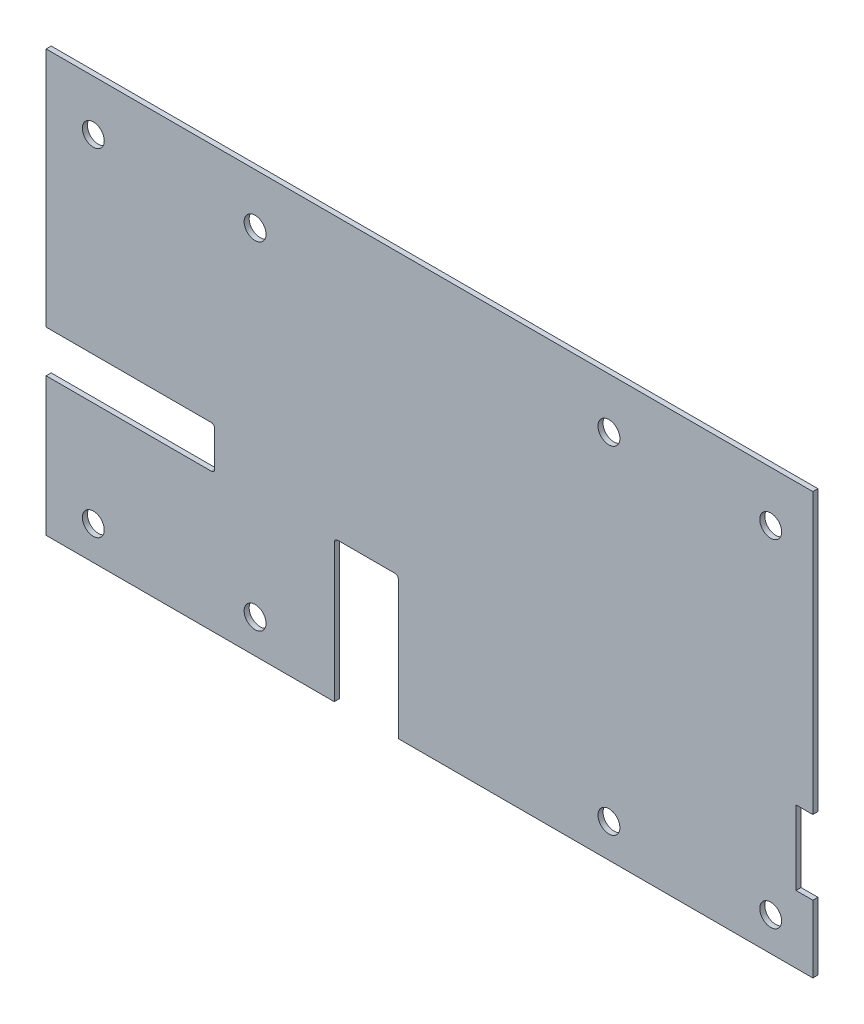
ISO-10303-21;
HEADER;
FILE_DESCRIPTION(('STEP AP214'),'2;1');
FILE_NAME('part.step','',(''),(''),'','','');
FILE_SCHEMA(('AUTOMOTIVE_DESIGN { 1 0 10303 214 1 1 1 1 }'));
ENDSEC;
DATA;
#1=APPLICATION_CONTEXT('core data for automotive mechanical design processes');
#2=APPLICATION_PROTOCOL_DEFINITION('international standard','automotive_design',2000,#1);
#3=PRODUCT_CONTEXT('',#1,'mechanical');
#4=PRODUCT('Part','Part','',(#3));
#5=PRODUCT_RELATED_PRODUCT_CATEGORY('part','',(#4));
#6=PRODUCT_DEFINITION_FORMATION('','',#4);
#7=PRODUCT_DEFINITION_CONTEXT('part definition',#1,'design');
#8=PRODUCT_DEFINITION('design','',#6,#7);
#9=PRODUCT_DEFINITION_SHAPE('','',#8);
#10=(LENGTH_UNIT() NAMED_UNIT(*) SI_UNIT(.MILLI.,.METRE.));
#11=(NAMED_UNIT(*) PLANE_ANGLE_UNIT() SI_UNIT($,.RADIAN.));
#12=(NAMED_UNIT(*) SI_UNIT($,.STERADIAN.) SOLID_ANGLE_UNIT());
#13=UNCERTAINTY_MEASURE_WITH_UNIT(LENGTH_MEASURE(1.E-05),#10,'distance_accuracy_value','');
#14=(GEOMETRIC_REPRESENTATION_CONTEXT(3) GLOBAL_UNCERTAINTY_ASSIGNED_CONTEXT((#13)) GLOBAL_UNIT_ASSIGNED_CONTEXT((#10,
#11,#12)) REPRESENTATION_CONTEXT('',''));
#15=CARTESIAN_POINT('',(0.,0.,0.));
#16=DIRECTION('',(0.,0.,1.));
#17=DIRECTION('',(1.,0.,0.));
#18=AXIS2_PLACEMENT_3D('',#15,#16,#17);
#19=CARTESIAN_POINT('',(-227.5,-125.,3.));
#20=DIRECTION('',(1.,0.,0.));
#21=DIRECTION('',(0.,0.,-1.));
#22=AXIS2_PLACEMENT_3D('',#19,#20,#21);
#23=PLANE('',#22);
#24=DIRECTION('',(0.,-1.,0.));
#25=VECTOR('',#24,1.);
#26=CARTESIAN_POINT('',(-227.5,-125.,0.));
#27=LINE('',#26,#25);
#28=CARTESIAN_POINT('',(-227.5,125.,0.));
#29=VERTEX_POINT('',#28);
#30=CARTESIAN_POINT('',(-227.5,-17.9999999999993,0.));
#31=VERTEX_POINT('',#30);
#32=EDGE_CURVE('E218',#29,#31,#27,.T.);
#33=ORIENTED_EDGE('',*,*,#32,.T.);
#34=DIRECTION('',(0.,0.,1.));
#35=VECTOR('',#34,1.);
#36=CARTESIAN_POINT('',(-227.5,-17.9999999999993,3.));
#37=LINE('',#36,#35);
#38=CARTESIAN_POINT('',(-227.5,-17.9999999999993,3.));
#39=VERTEX_POINT('',#38);
#40=EDGE_CURVE('E179',#31,#39,#37,.T.);
#41=ORIENTED_EDGE('',*,*,#40,.T.);
#42=DIRECTION('',(0.,-1.,0.));
#43=VECTOR('',#42,1.);
#44=CARTESIAN_POINT('',(-227.5,-125.,3.));
#45=LINE('',#44,#43);
#46=CARTESIAN_POINT('',(-227.5,125.,3.));
#47=VERTEX_POINT('',#46);
#48=EDGE_CURVE('E198',#47,#39,#45,.T.);
#49=ORIENTED_EDGE('',*,*,#48,.F.);
#50=DIRECTION('',(0.,0.,-1.));
#51=VECTOR('',#50,1.);
#52=CARTESIAN_POINT('',(-227.5,125.,3.));
#53=LINE('',#52,#51);
#54=EDGE_CURVE('E217',#47,#29,#53,.T.);
#55=ORIENTED_EDGE('',*,*,#54,.T.);
#56=EDGE_LOOP('',(#33,#41,#49,#55));
#57=FACE_BOUND('',#56,.T.);
#58=ADVANCED_FACE('F33',(#57),#23,.F.);
#59=CARTESIAN_POINT('',(227.5,-125.,3.));
#60=DIRECTION('',(0.,1.,0.));
#61=DIRECTION('',(-1.,0.,0.));
#62=AXIS2_PLACEMENT_3D('',#59,#60,#61);
#63=PLANE('',#62);
#64=DIRECTION('',(1.,0.,0.));
#65=VECTOR('',#64,1.);
#66=CARTESIAN_POINT('',(227.5,-125.,3.));
#67=LINE('',#66,#65);
#68=CARTESIAN_POINT('',(-18.5000000000001,-125.,3.));
#69=VERTEX_POINT('',#68);
#70=CARTESIAN_POINT('',(227.5,-125.,3.));
#71=VERTEX_POINT('',#70);
#72=EDGE_CURVE('E202',#69,#71,#67,.T.);
#73=ORIENTED_EDGE('',*,*,#72,.F.);
#74=DIRECTION('',(0.,0.,-1.));
#75=VECTOR('',#74,1.);
#76=CARTESIAN_POINT('',(-18.5000000000001,-125.,3.));
#77=LINE('',#76,#75);
#78=CARTESIAN_POINT('',(-18.5000000000001,-125.,0.));
#79=VERTEX_POINT('',#78);
#80=EDGE_CURVE('E180',#69,#79,#77,.T.);
#81=ORIENTED_EDGE('',*,*,#80,.T.);
#82=DIRECTION('',(1.,0.,0.));
#83=VECTOR('',#82,1.);
#84=CARTESIAN_POINT('',(227.5,-125.,0.));
#85=LINE('',#84,#83);
#86=CARTESIAN_POINT('',(227.5,-125.,0.));
#87=VERTEX_POINT('',#86);
#88=EDGE_CURVE('E221',#79,#87,#85,.T.);
#89=ORIENTED_EDGE('',*,*,#88,.T.);
#90=DIRECTION('',(0.,0.,-1.));
#91=VECTOR('',#90,1.);
#92=CARTESIAN_POINT('',(227.5,-125.,3.));
#93=LINE('',#92,#91);
#94=EDGE_CURVE('E234',#71,#87,#93,.T.);
#95=ORIENTED_EDGE('',*,*,#94,.F.);
#96=EDGE_LOOP('',(#73,#81,#89,#95));
#97=FACE_BOUND('',#96,.T.);
#98=ADVANCED_FACE('F373',(#97),#63,.F.);
#99=CARTESIAN_POINT('',(227.5,-125.,3.));
#100=DIRECTION('',(-1.,0.,0.));
#101=DIRECTION('',(0.,-1.,0.));
#102=AXIS2_PLACEMENT_3D('',#99,#100,#101);
#103=PLANE('',#102);
#104=DIRECTION('',(0.,1.,0.));
#105=VECTOR('',#104,1.);
#106=CARTESIAN_POINT('',(227.5,-125.,0.));
#107=LINE('',#106,#105);
#108=CARTESIAN_POINT('',(227.5,-85.,0.));
#109=VERTEX_POINT('',#108);
#110=EDGE_CURVE('E203',#87,#109,#107,.T.);
#111=ORIENTED_EDGE('',*,*,#110,.T.);
#112=DIRECTION('',(0.,0.,1.));
#113=VECTOR('',#112,1.);
#114=CARTESIAN_POINT('',(227.5,-85.,3.));
#115=LINE('',#114,#113);
#116=CARTESIAN_POINT('',(227.5,-85.,3.));
#117=VERTEX_POINT('',#116);
#118=EDGE_CURVE('E241',#109,#117,#115,.T.);
#119=ORIENTED_EDGE('',*,*,#118,.T.);
#120=DIRECTION('',(0.,1.,0.));
#121=VECTOR('',#120,1.);
#122=CARTESIAN_POINT('',(227.5,-125.,3.));
#123=LINE('',#122,#121);
#124=EDGE_CURVE('E212',#71,#117,#123,.T.);
#125=ORIENTED_EDGE('',*,*,#124,.F.);
#126=ORIENTED_EDGE('',*,*,#94,.T.);
#127=EDGE_LOOP('',(#111,#119,#125,#126));
#128=FACE_BOUND('',#127,.T.);
#129=ADVANCED_FACE('F379',(#128),#103,.F.);
#130=CARTESIAN_POINT('',(0.,0.,3.));
#131=DIRECTION('',(0.,0.,1.));
#132=DIRECTION('',(1.,0.,0.));
#133=AXIS2_PLACEMENT_3D('',#130,#131,#132);
#134=PLANE('',#133);
#135=DIRECTION('',(-1.,0.,0.));
#136=VECTOR('',#135,1.);
#137=CARTESIAN_POINT('',(-227.5,-17.9999999999993,3.));
#138=LINE('',#137,#136);
#139=CARTESIAN_POINT('',(-129.5,-17.9999999999993,3.));
#140=VERTEX_POINT('',#139);
#141=EDGE_CURVE('E289',#140,#39,#138,.T.);
#142=ORIENTED_EDGE('',*,*,#141,.F.);
#143=CARTESIAN_POINT('',(-129.5,-19.9999999999993,3.));
#144=DIRECTION('',(0.,0.,1.));
#145=DIRECTION('',(1.,0.,0.));
#146=AXIS2_PLACEMENT_3D('',#143,#144,#145);
#147=CIRCLE('',#146,2.);
#148=CARTESIAN_POINT('',(-127.5,-19.9999999999993,3.));
#149=VERTEX_POINT('',#148);
#150=EDGE_CURVE('E41',#140,#149,#147,.F.);
#151=ORIENTED_EDGE('',*,*,#150,.T.);
#152=DIRECTION('',(0.,1.,0.));
#153=VECTOR('',#152,1.);
#154=CARTESIAN_POINT('',(-127.5,-42.9999999999993,3.));
#155=LINE('',#154,#153);
#156=CARTESIAN_POINT('',(-127.5,-40.9999999999993,3.));
#157=VERTEX_POINT('',#156);
#158=EDGE_CURVE('E191',#157,#149,#155,.T.);
#159=ORIENTED_EDGE('',*,*,#158,.F.);
#160=CARTESIAN_POINT('',(-129.5,-40.9999999999993,3.));
#161=DIRECTION('',(0.,0.,1.));
#162=DIRECTION('',(1.,0.,0.));
#163=AXIS2_PLACEMENT_3D('',#160,#161,#162);
#164=CIRCLE('',#163,2.);
#165=CARTESIAN_POINT('',(-129.5,-42.9999999999993,3.));
#166=VERTEX_POINT('',#165);
#167=EDGE_CURVE('E190',#157,#166,#164,.F.);
#168=ORIENTED_EDGE('',*,*,#167,.T.);
#169=DIRECTION('',(1.,0.,0.));
#170=VECTOR('',#169,1.);
#171=CARTESIAN_POINT('',(-227.5,-42.9999999999993,3.));
#172=LINE('',#171,#170);
#173=CARTESIAN_POINT('',(-227.5,-42.9999999999993,3.));
#174=VERTEX_POINT('',#173);
#175=EDGE_CURVE('E172',#174,#166,#172,.T.);
#176=ORIENTED_EDGE('',*,*,#175,.F.);
#177=CARTESIAN_POINT('',(-227.5,-125.,3.));
#178=VERTEX_POINT('',#177);
#179=EDGE_CURVE('E187',#174,#178,#45,.T.);
#180=ORIENTED_EDGE('',*,*,#179,.T.);
#181=CARTESIAN_POINT('',(-56.5000000000001,-125.,3.));
#182=VERTEX_POINT('',#181);
#183=EDGE_CURVE('E209',#178,#182,#67,.T.);
#184=ORIENTED_EDGE('',*,*,#183,.T.);
#185=DIRECTION('',(0.,-1.,0.));
#186=VECTOR('',#185,1.);
#187=CARTESIAN_POINT('',(-56.5000000000001,-41.0000000000001,3.));
#188=LINE('',#187,#186);
#189=CARTESIAN_POINT('',(-56.5000000000001,-43.0000000000001,3.));
#190=VERTEX_POINT('',#189);
#191=EDGE_CURVE('E192',#190,#182,#188,.T.);
#192=ORIENTED_EDGE('',*,*,#191,.F.);
#193=CARTESIAN_POINT('',(-54.5000000000001,-43.0000000000001,3.));
#194=DIRECTION('',(0.,0.,1.));
#195=DIRECTION('',(1.,0.,0.));
#196=AXIS2_PLACEMENT_3D('',#193,#194,#195);
#197=CIRCLE('',#196,2.);
#198=CARTESIAN_POINT('',(-54.5000000000001,-41.0000000000001,3.));
#199=VERTEX_POINT('',#198);
#200=EDGE_CURVE('E282',#190,#199,#197,.F.);
#201=ORIENTED_EDGE('',*,*,#200,.T.);
#202=DIRECTION('',(-1.,0.,0.));
#203=VECTOR('',#202,1.);
#204=CARTESIAN_POINT('',(-18.5000000000001,-41.,3.));
#205=LINE('',#204,#203);
#206=CARTESIAN_POINT('',(-20.5000000000001,-41.,3.));
#207=VERTEX_POINT('',#206);
#208=EDGE_CURVE('E431',#207,#199,#205,.T.);
#209=ORIENTED_EDGE('',*,*,#208,.F.);
#210=CARTESIAN_POINT('',(-20.5000000000001,-43.,3.));
#211=DIRECTION('',(0.,0.,1.));
#212=DIRECTION('',(1.,0.,0.));
#213=AXIS2_PLACEMENT_3D('',#210,#211,#212);
#214=CIRCLE('',#213,2.);
#215=CARTESIAN_POINT('',(-18.5000000000001,-43.,3.));
#216=VERTEX_POINT('',#215);
#217=EDGE_CURVE('E278',#207,#216,#214,.F.);
#218=ORIENTED_EDGE('',*,*,#217,.T.);
#219=DIRECTION('',(0.,1.,0.));
#220=VECTOR('',#219,1.);
#221=CARTESIAN_POINT('',(-18.5000000000001,-41.,3.));
#222=LINE('',#221,#220);
#223=EDGE_CURVE('E436',#69,#216,#222,.T.);
#224=ORIENTED_EDGE('',*,*,#223,.F.);
#225=ORIENTED_EDGE('',*,*,#72,.T.);
#226=ORIENTED_EDGE('',*,*,#124,.T.);
#227=DIRECTION('',(1.,0.,0.));
#228=VECTOR('',#227,1.);
#229=CARTESIAN_POINT('',(227.5,-85.,3.));
#230=LINE('',#229,#228);
#231=CARTESIAN_POINT('',(217.5,-85.,3.));
#232=VERTEX_POINT('',#231);
#233=EDGE_CURVE('E449',#232,#117,#230,.T.);
#234=ORIENTED_EDGE('',*,*,#233,.F.);
#235=DIRECTION('',(0.,-1.,0.));
#236=VECTOR('',#235,1.);
#237=CARTESIAN_POINT('',(217.5,-41.,3.));
#238=LINE('',#237,#236);
#239=CARTESIAN_POINT('',(217.5,-41.,3.));
#240=VERTEX_POINT('',#239);
#241=EDGE_CURVE('E446',#240,#232,#238,.T.);
#242=ORIENTED_EDGE('',*,*,#241,.F.);
#243=DIRECTION('',(-1.,0.,0.));
#244=VECTOR('',#243,1.);
#245=CARTESIAN_POINT('',(227.5,-41.,3.));
#246=LINE('',#245,#244);
#247=CARTESIAN_POINT('',(227.5,-41.,3.));
#248=VERTEX_POINT('',#247);
#249=EDGE_CURVE('E443',#248,#240,#246,.T.);
#250=ORIENTED_EDGE('',*,*,#249,.F.);
#251=CARTESIAN_POINT('',(227.5,125.,3.));
#252=VERTEX_POINT('',#251);
#253=EDGE_CURVE('E211',#248,#252,#123,.T.);
#254=ORIENTED_EDGE('',*,*,#253,.T.);
#255=DIRECTION('',(-1.,0.,0.));
#256=VECTOR('',#255,1.);
#257=CARTESIAN_POINT('',(227.5,125.,3.));
#258=LINE('',#257,#256);
#259=EDGE_CURVE('E215',#252,#47,#258,.T.);
#260=ORIENTED_EDGE('',*,*,#259,.T.);
#261=ORIENTED_EDGE('',*,*,#48,.T.);
#262=EDGE_LOOP('',(#142,#151,#159,#168,#176,#180,#184,#192,#201,#209,#218,#224,#225,#226,#234,
#242,#250,#254,#260,#261));
#263=FACE_BOUND('',#262,.T.);
#264=CARTESIAN_POINT('',(-199.5,95.0000000000001,3.));
#265=DIRECTION('',(0.,0.,1.));
#266=DIRECTION('',(1.,0.,0.));
#267=AXIS2_PLACEMENT_3D('',#264,#265,#266);
#268=CIRCLE('',#267,6.50000000000002);
#269=CARTESIAN_POINT('',(-193.,95.0000000000001,3.));
#270=VERTEX_POINT('',#269);
#271=EDGE_CURVE('E312',#270,#270,#268,.T.);
#272=ORIENTED_EDGE('',*,*,#271,.F.);
#273=EDGE_LOOP('',(#272));
#274=FACE_BOUND('',#273,.T.);
#275=CARTESIAN_POINT('',(-103.5,-105.,3.));
#276=DIRECTION('',(0.,0.,1.));
#277=DIRECTION('',(1.,0.,0.));
#278=AXIS2_PLACEMENT_3D('',#275,#276,#277);
#279=CIRCLE('',#278,6.50000000000002);
#280=CARTESIAN_POINT('',(-96.9999999999999,-105.,3.));
#281=VERTEX_POINT('',#280);
#282=EDGE_CURVE('E324',#281,#281,#279,.T.);
#283=ORIENTED_EDGE('',*,*,#282,.F.);
#284=EDGE_LOOP('',(#283));
#285=FACE_BOUND('',#284,.T.);
#286=CARTESIAN_POINT('',(106.5,-105.,3.));
#287=DIRECTION('',(0.,0.,1.));
#288=DIRECTION('',(1.,0.,0.));
#289=AXIS2_PLACEMENT_3D('',#286,#287,#288);
#290=CIRCLE('',#289,6.50000000000002);
#291=CARTESIAN_POINT('',(113.,-105.,3.));
#292=VERTEX_POINT('',#291);
#293=EDGE_CURVE('E336',#292,#292,#290,.T.);
#294=ORIENTED_EDGE('',*,*,#293,.F.);
#295=EDGE_LOOP('',(#294));
#296=FACE_BOUND('',#295,.T.);
#297=CARTESIAN_POINT('',(106.5,95.0000000000001,3.));
#298=DIRECTION('',(0.,0.,1.));
#299=DIRECTION('',(1.,0.,0.));
#300=AXIS2_PLACEMENT_3D('',#297,#298,#299);
#301=CIRCLE('',#300,6.50000000000002);
#302=CARTESIAN_POINT('',(113.,95.0000000000001,3.));
#303=VERTEX_POINT('',#302);
#304=EDGE_CURVE('E346',#303,#303,#301,.T.);
#305=ORIENTED_EDGE('',*,*,#304,.F.);
#306=EDGE_LOOP('',(#305));
#307=FACE_BOUND('',#306,.T.);
#308=CARTESIAN_POINT('',(202.5,95.0000000000001,3.));
#309=DIRECTION('',(0.,0.,1.));
#310=DIRECTION('',(1.,0.,0.));
#311=AXIS2_PLACEMENT_3D('',#308,#309,#310);
#312=CIRCLE('',#311,6.50000000000002);
#313=CARTESIAN_POINT('',(209.,95.0000000000001,3.));
#314=VERTEX_POINT('',#313);
#315=EDGE_CURVE('E342',#314,#314,#312,.T.);
#316=ORIENTED_EDGE('',*,*,#315,.F.);
#317=EDGE_LOOP('',(#316));
#318=FACE_BOUND('',#317,.T.);
#319=CARTESIAN_POINT('',(202.5,-105.,3.));
#320=DIRECTION('',(0.,0.,1.));
#321=DIRECTION('',(1.,0.,0.));
#322=AXIS2_PLACEMENT_3D('',#319,#320,#321);
#323=CIRCLE('',#322,6.50000000000007);
#324=CARTESIAN_POINT('',(209.,-105.,3.));
#325=VERTEX_POINT('',#324);
#326=EDGE_CURVE('E330',#325,#325,#323,.T.);
#327=ORIENTED_EDGE('',*,*,#326,.F.);
#328=EDGE_LOOP('',(#327));
#329=FACE_BOUND('',#328,.T.);
#330=CARTESIAN_POINT('',(-103.5,95.0000000000001,3.));
#331=DIRECTION('',(0.,0.,1.));
#332=DIRECTION('',(1.,0.,0.));
#333=AXIS2_PLACEMENT_3D('',#330,#331,#332);
#334=CIRCLE('',#333,6.50000000000002);
#335=CARTESIAN_POINT('',(-97.,95.0000000000001,3.));
#336=VERTEX_POINT('',#335);
#337=EDGE_CURVE('E318',#336,#336,#334,.T.);
#338=ORIENTED_EDGE('',*,*,#337,.F.);
#339=EDGE_LOOP('',(#338));
#340=FACE_BOUND('',#339,.T.);
#341=CARTESIAN_POINT('',(-199.5,-105.,3.));
#342=DIRECTION('',(0.,0.,1.));
#343=DIRECTION('',(1.,0.,0.));
#344=AXIS2_PLACEMENT_3D('',#341,#342,#343);
#345=CIRCLE('',#344,6.50000000000002);
#346=CARTESIAN_POINT('',(-193.,-105.,3.));
#347=VERTEX_POINT('',#346);
#348=EDGE_CURVE('E303',#347,#347,#345,.T.);
#349=ORIENTED_EDGE('',*,*,#348,.F.);
#350=EDGE_LOOP('',(#349));
#351=FACE_BOUND('',#350,.T.);
#352=ADVANCED_FACE('F184',(#263,#274,#285,#296,#307,#318,#329,#340,#351),#134,.T.);
#353=CARTESIAN_POINT('',(0.,0.,0.));
#354=DIRECTION('',(0.,0.,1.));
#355=DIRECTION('',(1.,0.,0.));
#356=AXIS2_PLACEMENT_3D('',#353,#354,#355);
#357=PLANE('',#356);
#358=DIRECTION('',(1.,0.,0.));
#359=VECTOR('',#358,1.);
#360=CARTESIAN_POINT('',(0.,-42.9999999999993,0.));
#361=LINE('',#360,#359);
#362=CARTESIAN_POINT('',(-227.5,-42.9999999999993,0.));
#363=VERTEX_POINT('',#362);
#364=CARTESIAN_POINT('',(-129.5,-42.9999999999993,0.));
#365=VERTEX_POINT('',#364);
#366=EDGE_CURVE('E175',#363,#365,#361,.T.);
#367=ORIENTED_EDGE('',*,*,#366,.T.);
#368=CARTESIAN_POINT('',(-129.5,-40.9999999999993,0.));
#369=DIRECTION('',(0.,0.,1.));
#370=DIRECTION('',(1.,0.,0.));
#371=AXIS2_PLACEMENT_3D('',#368,#369,#370);
#372=CIRCLE('',#371,2.);
#373=CARTESIAN_POINT('',(-127.5,-40.9999999999993,0.));
#374=VERTEX_POINT('',#373);
#375=EDGE_CURVE('E287',#365,#374,#372,.T.);
#376=ORIENTED_EDGE('',*,*,#375,.T.);
#377=DIRECTION('',(0.,1.,0.));
#378=VECTOR('',#377,1.);
#379=CARTESIAN_POINT('',(-127.5,0.,0.));
#380=LINE('',#379,#378);
#381=CARTESIAN_POINT('',(-127.5,-19.9999999999993,0.));
#382=VERTEX_POINT('',#381);
#383=EDGE_CURVE('E257',#374,#382,#380,.T.);
#384=ORIENTED_EDGE('',*,*,#383,.T.);
#385=CARTESIAN_POINT('',(-129.5,-19.9999999999993,0.));
#386=DIRECTION('',(0.,0.,1.));
#387=DIRECTION('',(1.,0.,0.));
#388=AXIS2_PLACEMENT_3D('',#385,#386,#387);
#389=CIRCLE('',#388,2.);
#390=CARTESIAN_POINT('',(-129.5,-17.9999999999993,0.));
#391=VERTEX_POINT('',#390);
#392=EDGE_CURVE('E11',#382,#391,#389,.T.);
#393=ORIENTED_EDGE('',*,*,#392,.T.);
#394=DIRECTION('',(-1.,0.,0.));
#395=VECTOR('',#394,1.);
#396=CARTESIAN_POINT('',(0.,-17.9999999999993,0.));
#397=LINE('',#396,#395);
#398=EDGE_CURVE('E298',#391,#31,#397,.T.);
#399=ORIENTED_EDGE('',*,*,#398,.T.);
#400=ORIENTED_EDGE('',*,*,#32,.F.);
#401=DIRECTION('',(-1.,0.,0.));
#402=VECTOR('',#401,1.);
#403=CARTESIAN_POINT('',(227.5,125.,0.));
#404=LINE('',#403,#402);
#405=CARTESIAN_POINT('',(227.5,125.,0.));
#406=VERTEX_POINT('',#405);
#407=EDGE_CURVE('E199',#406,#29,#404,.T.);
#408=ORIENTED_EDGE('',*,*,#407,.F.);
#409=CARTESIAN_POINT('',(227.5,-41.,0.));
#410=VERTEX_POINT('',#409);
#411=EDGE_CURVE('E226',#410,#406,#107,.T.);
#412=ORIENTED_EDGE('',*,*,#411,.F.);
#413=DIRECTION('',(-1.,0.,0.));
#414=VECTOR('',#413,1.);
#415=CARTESIAN_POINT('',(0.,-40.9999999999998,0.));
#416=LINE('',#415,#414);
#417=CARTESIAN_POINT('',(217.5,-41.,0.));
#418=VERTEX_POINT('',#417);
#419=EDGE_CURVE('E415',#410,#418,#416,.T.);
#420=ORIENTED_EDGE('',*,*,#419,.T.);
#421=DIRECTION('',(0.,-1.,0.));
#422=VECTOR('',#421,1.);
#423=CARTESIAN_POINT('',(217.5,0.,0.));
#424=LINE('',#423,#422);
#425=CARTESIAN_POINT('',(217.5,-85.,0.));
#426=VERTEX_POINT('',#425);
#427=EDGE_CURVE('E251',#418,#426,#424,.T.);
#428=ORIENTED_EDGE('',*,*,#427,.T.);
#429=DIRECTION('',(1.,0.,0.));
#430=VECTOR('',#429,1.);
#431=CARTESIAN_POINT('',(-1.17961196366422E-13,-84.9999999999997,0.));
#432=LINE('',#431,#430);
#433=EDGE_CURVE('E410',#426,#109,#432,.T.);
#434=ORIENTED_EDGE('',*,*,#433,.T.);
#435=ORIENTED_EDGE('',*,*,#110,.F.);
#436=ORIENTED_EDGE('',*,*,#88,.F.);
#437=DIRECTION('',(0.,1.,0.));
#438=VECTOR('',#437,1.);
#439=CARTESIAN_POINT('',(-18.5000000000001,0.,0.));
#440=LINE('',#439,#438);
#441=CARTESIAN_POINT('',(-18.5000000000001,-43.,0.));
#442=VERTEX_POINT('',#441);
#443=EDGE_CURVE('E305',#79,#442,#440,.T.);
#444=ORIENTED_EDGE('',*,*,#443,.T.);
#445=CARTESIAN_POINT('',(-20.5000000000001,-43.,0.));
#446=DIRECTION('',(0.,0.,1.));
#447=DIRECTION('',(1.,0.,0.));
#448=AXIS2_PLACEMENT_3D('',#445,#446,#447);
#449=CIRCLE('',#448,2.);
#450=CARTESIAN_POINT('',(-20.5000000000001,-41.0000000000001,0.));
#451=VERTEX_POINT('',#450);
#452=EDGE_CURVE('E280',#442,#451,#449,.T.);
#453=ORIENTED_EDGE('',*,*,#452,.T.);
#454=DIRECTION('',(-1.,0.,0.));
#455=VECTOR('',#454,1.);
#456=CARTESIAN_POINT('',(0.,-41.,0.));
#457=LINE('',#456,#455);
#458=CARTESIAN_POINT('',(-54.5000000000001,-41.0000000000001,0.));
#459=VERTEX_POINT('',#458);
#460=EDGE_CURVE('E254',#451,#459,#457,.T.);
#461=ORIENTED_EDGE('',*,*,#460,.T.);
#462=CARTESIAN_POINT('',(-54.5000000000001,-43.0000000000001,0.));
#463=DIRECTION('',(0.,0.,1.));
#464=DIRECTION('',(1.,0.,0.));
#465=AXIS2_PLACEMENT_3D('',#462,#463,#464);
#466=CIRCLE('',#465,2.);
#467=CARTESIAN_POINT('',(-56.5000000000001,-43.0000000000001,0.));
#468=VERTEX_POINT('',#467);
#469=EDGE_CURVE('E284',#459,#468,#466,.T.);
#470=ORIENTED_EDGE('',*,*,#469,.T.);
#471=DIRECTION('',(0.,-1.,0.));
#472=VECTOR('',#471,1.);
#473=CARTESIAN_POINT('',(-56.5000000000001,0.,0.));
#474=LINE('',#473,#472);
#475=CARTESIAN_POINT('',(-56.5000000000001,-125.,0.));
#476=VERTEX_POINT('',#475);
#477=EDGE_CURVE('E414',#468,#476,#474,.T.);
#478=ORIENTED_EDGE('',*,*,#477,.T.);
#479=CARTESIAN_POINT('',(-227.5,-125.,0.));
#480=VERTEX_POINT('',#479);
#481=EDGE_CURVE('E223',#480,#476,#85,.T.);
#482=ORIENTED_EDGE('',*,*,#481,.F.);
#483=EDGE_CURVE('E222',#363,#480,#27,.T.);
#484=ORIENTED_EDGE('',*,*,#483,.F.);
#485=EDGE_LOOP('',(#367,#376,#384,#393,#399,#400,#408,#412,#420,#428,#434,#435,#436,#444,#453,
#461,#470,#478,#482,#484));
#486=FACE_BOUND('',#485,.T.);
#487=CARTESIAN_POINT('',(106.5,95.0000000000001,0.));
#488=DIRECTION('',(0.,0.,1.));
#489=DIRECTION('',(1.,0.,0.));
#490=AXIS2_PLACEMENT_3D('',#487,#488,#489);
#491=CIRCLE('',#490,6.50000000000002);
#492=CARTESIAN_POINT('',(113.,95.0000000000001,0.));
#493=VERTEX_POINT('',#492);
#494=EDGE_CURVE('E207',#493,#493,#491,.T.);
#495=ORIENTED_EDGE('',*,*,#494,.T.);
#496=EDGE_LOOP('',(#495));
#497=FACE_BOUND('',#496,.T.);
#498=CARTESIAN_POINT('',(202.5,95.0000000000001,0.));
#499=DIRECTION('',(0.,0.,1.));
#500=DIRECTION('',(1.,0.,0.));
#501=AXIS2_PLACEMENT_3D('',#498,#499,#500);
#502=CIRCLE('',#501,6.50000000000002);
#503=CARTESIAN_POINT('',(209.,95.0000000000001,0.));
#504=VERTEX_POINT('',#503);
#505=EDGE_CURVE('E339',#504,#504,#502,.T.);
#506=ORIENTED_EDGE('',*,*,#505,.T.);
#507=EDGE_LOOP('',(#506));
#508=FACE_BOUND('',#507,.T.);
#509=CARTESIAN_POINT('',(106.5,-105.,0.));
#510=DIRECTION('',(0.,0.,1.));
#511=DIRECTION('',(1.,0.,0.));
#512=AXIS2_PLACEMENT_3D('',#509,#510,#511);
#513=CIRCLE('',#512,6.50000000000002);
#514=CARTESIAN_POINT('',(113.,-105.,0.));
#515=VERTEX_POINT('',#514);
#516=EDGE_CURVE('E333',#515,#515,#513,.T.);
#517=ORIENTED_EDGE('',*,*,#516,.T.);
#518=EDGE_LOOP('',(#517));
#519=FACE_BOUND('',#518,.T.);
#520=CARTESIAN_POINT('',(202.5,-105.,0.));
#521=DIRECTION('',(0.,0.,1.));
#522=DIRECTION('',(1.,0.,0.));
#523=AXIS2_PLACEMENT_3D('',#520,#521,#522);
#524=CIRCLE('',#523,6.50000000000007);
#525=CARTESIAN_POINT('',(209.,-105.,0.));
#526=VERTEX_POINT('',#525);
#527=EDGE_CURVE('E327',#526,#526,#524,.T.);
#528=ORIENTED_EDGE('',*,*,#527,.T.);
#529=EDGE_LOOP('',(#528));
#530=FACE_BOUND('',#529,.T.);
#531=CARTESIAN_POINT('',(-103.5,-105.,0.));
#532=DIRECTION('',(0.,0.,1.));
#533=DIRECTION('',(1.,0.,0.));
#534=AXIS2_PLACEMENT_3D('',#531,#532,#533);
#535=CIRCLE('',#534,6.50000000000002);
#536=CARTESIAN_POINT('',(-96.9999999999999,-105.,0.));
#537=VERTEX_POINT('',#536);
#538=EDGE_CURVE('E321',#537,#537,#535,.T.);
#539=ORIENTED_EDGE('',*,*,#538,.T.);
#540=EDGE_LOOP('',(#539));
#541=FACE_BOUND('',#540,.T.);
#542=CARTESIAN_POINT('',(-103.5,95.0000000000001,0.));
#543=DIRECTION('',(0.,0.,1.));
#544=DIRECTION('',(1.,0.,0.));
#545=AXIS2_PLACEMENT_3D('',#542,#543,#544);
#546=CIRCLE('',#545,6.50000000000002);
#547=CARTESIAN_POINT('',(-97.,95.0000000000001,0.));
#548=VERTEX_POINT('',#547);
#549=EDGE_CURVE('E315',#548,#548,#546,.T.);
#550=ORIENTED_EDGE('',*,*,#549,.T.);
#551=EDGE_LOOP('',(#550));
#552=FACE_BOUND('',#551,.T.);
#553=CARTESIAN_POINT('',(-199.5,95.0000000000001,0.));
#554=DIRECTION('',(0.,0.,1.));
#555=DIRECTION('',(1.,0.,0.));
#556=AXIS2_PLACEMENT_3D('',#553,#554,#555);
#557=CIRCLE('',#556,6.50000000000002);
#558=CARTESIAN_POINT('',(-193.,95.0000000000001,0.));
#559=VERTEX_POINT('',#558);
#560=EDGE_CURVE('E310',#559,#559,#557,.T.);
#561=ORIENTED_EDGE('',*,*,#560,.T.);
#562=EDGE_LOOP('',(#561));
#563=FACE_BOUND('',#562,.T.);
#564=CARTESIAN_POINT('',(-199.5,-105.,0.));
#565=DIRECTION('',(0.,0.,1.));
#566=DIRECTION('',(1.,0.,0.));
#567=AXIS2_PLACEMENT_3D('',#564,#565,#566);
#568=CIRCLE('',#567,6.50000000000002);
#569=CARTESIAN_POINT('',(-193.,-105.,0.));
#570=VERTEX_POINT('',#569);
#571=EDGE_CURVE('E300',#570,#570,#568,.T.);
#572=ORIENTED_EDGE('',*,*,#571,.T.);
#573=EDGE_LOOP('',(#572));
#574=FACE_BOUND('',#573,.T.);
#575=ADVANCED_FACE('F353',(#486,#497,#508,#519,#530,#541,#552,#563,#574),#357,.F.);
#576=ORIENTED_EDGE('',*,*,#179,.F.);
#577=DIRECTION('',(0.,0.,-1.));
#578=VECTOR('',#577,1.);
#579=CARTESIAN_POINT('',(-227.5,-42.9999999999993,3.));
#580=LINE('',#579,#578);
#581=EDGE_CURVE('E169',#174,#363,#580,.T.);
#582=ORIENTED_EDGE('',*,*,#581,.T.);
#583=ORIENTED_EDGE('',*,*,#483,.T.);
#584=DIRECTION('',(0.,0.,-1.));
#585=VECTOR('',#584,1.);
#586=CARTESIAN_POINT('',(-227.5,-125.,3.));
#587=LINE('',#586,#585);
#588=EDGE_CURVE('E197',#178,#480,#587,.T.);
#589=ORIENTED_EDGE('',*,*,#588,.F.);
#590=EDGE_LOOP('',(#576,#582,#583,#589));
#591=FACE_BOUND('',#590,.T.);
#592=ADVANCED_FACE('F195',(#591),#23,.F.);
#593=ORIENTED_EDGE('',*,*,#481,.T.);
#594=DIRECTION('',(0.,0.,1.));
#595=VECTOR('',#594,1.);
#596=CARTESIAN_POINT('',(-56.5000000000001,-125.,3.));
#597=LINE('',#596,#595);
#598=EDGE_CURVE('E244',#476,#182,#597,.T.);
#599=ORIENTED_EDGE('',*,*,#598,.T.);
#600=ORIENTED_EDGE('',*,*,#183,.F.);
#601=ORIENTED_EDGE('',*,*,#588,.T.);
#602=EDGE_LOOP('',(#593,#599,#600,#601));
#603=FACE_BOUND('',#602,.T.);
#604=ADVANCED_FACE('F382',(#603),#63,.F.);
#605=ORIENTED_EDGE('',*,*,#253,.F.);
#606=DIRECTION('',(0.,0.,-1.));
#607=VECTOR('',#606,1.);
#608=CARTESIAN_POINT('',(227.5,-41.,3.));
#609=LINE('',#608,#607);
#610=EDGE_CURVE('E238',#248,#410,#609,.T.);
#611=ORIENTED_EDGE('',*,*,#610,.T.);
#612=ORIENTED_EDGE('',*,*,#411,.T.);
#613=DIRECTION('',(0.,0.,-1.));
#614=VECTOR('',#613,1.);
#615=CARTESIAN_POINT('',(227.5,125.,3.));
#616=LINE('',#615,#614);
#617=EDGE_CURVE('E231',#252,#406,#616,.T.);
#618=ORIENTED_EDGE('',*,*,#617,.F.);
#619=EDGE_LOOP('',(#605,#611,#612,#618));
#620=FACE_BOUND('',#619,.T.);
#621=ADVANCED_FACE('F368',(#620),#103,.F.);
#622=CARTESIAN_POINT('',(227.5,125.,3.));
#623=DIRECTION('',(0.,-1.,0.));
#624=DIRECTION('',(1.,0.,0.));
#625=AXIS2_PLACEMENT_3D('',#622,#623,#624);
#626=PLANE('',#625);
#627=ORIENTED_EDGE('',*,*,#407,.T.);
#628=ORIENTED_EDGE('',*,*,#54,.F.);
#629=ORIENTED_EDGE('',*,*,#259,.F.);
#630=ORIENTED_EDGE('',*,*,#617,.T.);
#631=EDGE_LOOP('',(#627,#628,#629,#630));
#632=FACE_BOUND('',#631,.T.);
#633=ADVANCED_FACE('F359',(#632),#626,.F.);
#634=CARTESIAN_POINT('',(106.5,95.0000000000001,3.));
#635=DIRECTION('',(0.,0.,-1.));
#636=DIRECTION('',(-1.,0.,0.));
#637=AXIS2_PLACEMENT_3D('',#634,#635,#636);
#638=CYLINDRICAL_SURFACE('',#637,6.50000000000002);
#639=ORIENTED_EDGE('',*,*,#304,.T.);
#640=EDGE_LOOP('',(#639));
#641=FACE_BOUND('',#640,.T.);
#642=ORIENTED_EDGE('',*,*,#494,.F.);
#643=EDGE_LOOP('',(#642));
#644=FACE_BOUND('',#643,.T.);
#645=ADVANCED_FACE('F356',(#641,#644),#638,.F.);
#646=CARTESIAN_POINT('',(202.5,95.0000000000001,3.));
#647=DIRECTION('',(0.,0.,-1.));
#648=DIRECTION('',(-1.,0.,0.));
#649=AXIS2_PLACEMENT_3D('',#646,#647,#648);
#650=CYLINDRICAL_SURFACE('',#649,6.50000000000002);
#651=ORIENTED_EDGE('',*,*,#315,.T.);
#652=EDGE_LOOP('',(#651));
#653=FACE_BOUND('',#652,.T.);
#654=ORIENTED_EDGE('',*,*,#505,.F.);
#655=EDGE_LOOP('',(#654));
#656=FACE_BOUND('',#655,.T.);
#657=ADVANCED_FACE('F358',(#653,#656),#650,.F.);
#658=CARTESIAN_POINT('',(106.5,-105.,3.));
#659=DIRECTION('',(0.,0.,-1.));
#660=DIRECTION('',(-1.,0.,0.));
#661=AXIS2_PLACEMENT_3D('',#658,#659,#660);
#662=CYLINDRICAL_SURFACE('',#661,6.50000000000002);
#663=ORIENTED_EDGE('',*,*,#293,.T.);
#664=EDGE_LOOP('',(#663));
#665=FACE_BOUND('',#664,.T.);
#666=ORIENTED_EDGE('',*,*,#516,.F.);
#667=EDGE_LOOP('',(#666));
#668=FACE_BOUND('',#667,.T.);
#669=ADVANCED_FACE('F365',(#665,#668),#662,.F.);
#670=CARTESIAN_POINT('',(202.5,-105.,3.));
#671=DIRECTION('',(0.,0.,-1.));
#672=DIRECTION('',(-1.,0.,0.));
#673=AXIS2_PLACEMENT_3D('',#670,#671,#672);
#674=CYLINDRICAL_SURFACE('',#673,6.50000000000007);
#675=ORIENTED_EDGE('',*,*,#326,.T.);
#676=EDGE_LOOP('',(#675));
#677=FACE_BOUND('',#676,.T.);
#678=ORIENTED_EDGE('',*,*,#527,.F.);
#679=EDGE_LOOP('',(#678));
#680=FACE_BOUND('',#679,.T.);
#681=ADVANCED_FACE('F488',(#677,#680),#674,.F.);
#682=CARTESIAN_POINT('',(-103.5,-105.,3.));
#683=DIRECTION('',(0.,0.,-1.));
#684=DIRECTION('',(-1.,0.,0.));
#685=AXIS2_PLACEMENT_3D('',#682,#683,#684);
#686=CYLINDRICAL_SURFACE('',#685,6.50000000000002);
#687=ORIENTED_EDGE('',*,*,#282,.T.);
#688=EDGE_LOOP('',(#687));
#689=FACE_BOUND('',#688,.T.);
#690=ORIENTED_EDGE('',*,*,#538,.F.);
#691=EDGE_LOOP('',(#690));
#692=FACE_BOUND('',#691,.T.);
#693=ADVANCED_FACE('F484',(#689,#692),#686,.F.);
#694=CARTESIAN_POINT('',(-103.5,95.0000000000001,3.));
#695=DIRECTION('',(0.,0.,-1.));
#696=DIRECTION('',(-1.,0.,0.));
#697=AXIS2_PLACEMENT_3D('',#694,#695,#696);
#698=CYLINDRICAL_SURFACE('',#697,6.50000000000002);
#699=ORIENTED_EDGE('',*,*,#337,.T.);
#700=EDGE_LOOP('',(#699));
#701=FACE_BOUND('',#700,.T.);
#702=ORIENTED_EDGE('',*,*,#549,.F.);
#703=EDGE_LOOP('',(#702));
#704=FACE_BOUND('',#703,.T.);
#705=ADVANCED_FACE('F480',(#701,#704),#698,.F.);
#706=CARTESIAN_POINT('',(-199.5,95.0000000000001,3.));
#707=DIRECTION('',(0.,0.,-1.));
#708=DIRECTION('',(-1.,0.,0.));
#709=AXIS2_PLACEMENT_3D('',#706,#707,#708);
#710=CYLINDRICAL_SURFACE('',#709,6.50000000000002);
#711=ORIENTED_EDGE('',*,*,#271,.T.);
#712=EDGE_LOOP('',(#711));
#713=FACE_BOUND('',#712,.T.);
#714=ORIENTED_EDGE('',*,*,#560,.F.);
#715=EDGE_LOOP('',(#714));
#716=FACE_BOUND('',#715,.T.);
#717=ADVANCED_FACE('F476',(#713,#716),#710,.F.);
#718=CARTESIAN_POINT('',(-199.5,-105.,3.));
#719=DIRECTION('',(0.,0.,-1.));
#720=DIRECTION('',(-1.,0.,0.));
#721=AXIS2_PLACEMENT_3D('',#718,#719,#720);
#722=CYLINDRICAL_SURFACE('',#721,6.50000000000002);
#723=ORIENTED_EDGE('',*,*,#348,.T.);
#724=EDGE_LOOP('',(#723));
#725=FACE_BOUND('',#724,.T.);
#726=ORIENTED_EDGE('',*,*,#571,.F.);
#727=EDGE_LOOP('',(#726));
#728=FACE_BOUND('',#727,.T.);
#729=ADVANCED_FACE('F468',(#725,#728),#722,.F.);
#730=CARTESIAN_POINT('',(217.5,-41.,-7.));
#731=DIRECTION('',(-1.,0.,0.));
#732=DIRECTION('',(0.,0.,1.));
#733=AXIS2_PLACEMENT_3D('',#730,#731,#732);
#734=PLANE('',#733);
#735=DIRECTION('',(0.,0.,1.));
#736=VECTOR('',#735,1.);
#737=CARTESIAN_POINT('',(217.5,-41.,-7.));
#738=LINE('',#737,#736);
#739=EDGE_CURVE('E451',#418,#240,#738,.T.);
#740=ORIENTED_EDGE('',*,*,#739,.T.);
#741=ORIENTED_EDGE('',*,*,#241,.T.);
#742=DIRECTION('',(0.,0.,1.));
#743=VECTOR('',#742,1.);
#744=CARTESIAN_POINT('',(217.5,-85.,-7.));
#745=LINE('',#744,#743);
#746=EDGE_CURVE('E439',#426,#232,#745,.T.);
#747=ORIENTED_EDGE('',*,*,#746,.F.);
#748=ORIENTED_EDGE('',*,*,#427,.F.);
#749=EDGE_LOOP('',(#740,#741,#747,#748));
#750=FACE_BOUND('',#749,.T.);
#751=ADVANCED_FACE('F454',(#750),#734,.F.);
#752=CARTESIAN_POINT('',(227.5,-85.,-7.));
#753=DIRECTION('',(0.,-1.,0.));
#754=DIRECTION('',(1.,0.,0.));
#755=AXIS2_PLACEMENT_3D('',#752,#753,#754);
#756=PLANE('',#755);
#757=ORIENTED_EDGE('',*,*,#746,.T.);
#758=ORIENTED_EDGE('',*,*,#233,.T.);
#759=ORIENTED_EDGE('',*,*,#118,.F.);
#760=ORIENTED_EDGE('',*,*,#433,.F.);
#761=EDGE_LOOP('',(#757,#758,#759,#760));
#762=FACE_BOUND('',#761,.T.);
#763=ADVANCED_FACE('F460',(#762),#756,.F.);
#764=CARTESIAN_POINT('',(227.5,-41.,-7.));
#765=DIRECTION('',(0.,1.,0.));
#766=DIRECTION('',(-1.,0.,0.));
#767=AXIS2_PLACEMENT_3D('',#764,#765,#766);
#768=PLANE('',#767);
#769=ORIENTED_EDGE('',*,*,#610,.F.);
#770=ORIENTED_EDGE('',*,*,#249,.T.);
#771=ORIENTED_EDGE('',*,*,#739,.F.);
#772=ORIENTED_EDGE('',*,*,#419,.F.);
#773=EDGE_LOOP('',(#769,#770,#771,#772));
#774=FACE_BOUND('',#773,.T.);
#775=ADVANCED_FACE('F459',(#774),#768,.F.);
#776=CARTESIAN_POINT('',(-18.5000000000001,-41.,-7.));
#777=DIRECTION('',(0.,1.,0.));
#778=DIRECTION('',(-1.,0.,0.));
#779=AXIS2_PLACEMENT_3D('',#776,#777,#778);
#780=PLANE('',#779);
#781=ORIENTED_EDGE('',*,*,#460,.F.);
#782=DIRECTION('',(0.,0.,1.));
#783=VECTOR('',#782,1.);
#784=CARTESIAN_POINT('',(-20.5000000000001,-41.,3.));
#785=LINE('',#784,#783);
#786=EDGE_CURVE('E261',#451,#207,#785,.T.);
#787=ORIENTED_EDGE('',*,*,#786,.T.);
#788=ORIENTED_EDGE('',*,*,#208,.T.);
#789=DIRECTION('',(0.,0.,1.));
#790=VECTOR('',#789,1.);
#791=CARTESIAN_POINT('',(-54.5000000000001,-41.0000000000001,0.));
#792=LINE('',#791,#790);
#793=EDGE_CURVE('E259',#199,#459,#792,.F.);
#794=ORIENTED_EDGE('',*,*,#793,.T.);
#795=EDGE_LOOP('',(#781,#787,#788,#794));
#796=FACE_BOUND('',#795,.T.);
#797=ADVANCED_FACE('F430',(#796),#780,.F.);
#798=CARTESIAN_POINT('',(-18.5000000000001,-41.,-7.));
#799=DIRECTION('',(1.,0.,0.));
#800=DIRECTION('',(0.,0.,-1.));
#801=AXIS2_PLACEMENT_3D('',#798,#799,#800);
#802=PLANE('',#801);
#803=ORIENTED_EDGE('',*,*,#223,.T.);
#804=DIRECTION('',(0.,0.,1.));
#805=VECTOR('',#804,1.);
#806=CARTESIAN_POINT('',(-18.5000000000001,-43.,0.));
#807=LINE('',#806,#805);
#808=EDGE_CURVE('E264',#216,#442,#807,.F.);
#809=ORIENTED_EDGE('',*,*,#808,.T.);
#810=ORIENTED_EDGE('',*,*,#443,.F.);
#811=ORIENTED_EDGE('',*,*,#80,.F.);
#812=EDGE_LOOP('',(#803,#809,#810,#811));
#813=FACE_BOUND('',#812,.T.);
#814=ADVANCED_FACE('F471',(#813),#802,.F.);
#815=CARTESIAN_POINT('',(-56.5000000000001,-41.0000000000001,-7.));
#816=DIRECTION('',(-1.,0.,0.));
#817=DIRECTION('',(0.,-1.,0.));
#818=AXIS2_PLACEMENT_3D('',#815,#816,#817);
#819=PLANE('',#818);
#820=ORIENTED_EDGE('',*,*,#477,.F.);
#821=DIRECTION('',(0.,0.,1.));
#822=VECTOR('',#821,1.);
#823=CARTESIAN_POINT('',(-56.5000000000001,-43.0000000000001,3.));
#824=LINE('',#823,#822);
#825=EDGE_CURVE('E266',#468,#190,#824,.T.);
#826=ORIENTED_EDGE('',*,*,#825,.T.);
#827=ORIENTED_EDGE('',*,*,#191,.T.);
#828=ORIENTED_EDGE('',*,*,#598,.F.);
#829=EDGE_LOOP('',(#820,#826,#827,#828));
#830=FACE_BOUND('',#829,.T.);
#831=ADVANCED_FACE('F595',(#830),#819,.F.);
#832=CARTESIAN_POINT('',(-127.5,-42.9999999999993,-7.));
#833=DIRECTION('',(1.,0.,0.));
#834=DIRECTION('',(0.,0.,-1.));
#835=AXIS2_PLACEMENT_3D('',#832,#833,#834);
#836=PLANE('',#835);
#837=ORIENTED_EDGE('',*,*,#383,.F.);
#838=DIRECTION('',(0.,0.,1.));
#839=VECTOR('',#838,1.);
#840=CARTESIAN_POINT('',(-127.5,-40.9999999999993,3.));
#841=LINE('',#840,#839);
#842=EDGE_CURVE('E271',#374,#157,#841,.T.);
#843=ORIENTED_EDGE('',*,*,#842,.T.);
#844=ORIENTED_EDGE('',*,*,#158,.T.);
#845=DIRECTION('',(0.,0.,1.));
#846=VECTOR('',#845,1.);
#847=CARTESIAN_POINT('',(-127.5,-19.9999999999993,0.));
#848=LINE('',#847,#846);
#849=EDGE_CURVE('E269',#149,#382,#848,.F.);
#850=ORIENTED_EDGE('',*,*,#849,.T.);
#851=EDGE_LOOP('',(#837,#843,#844,#850));
#852=FACE_BOUND('',#851,.T.);
#853=ADVANCED_FACE('F292',(#852),#836,.F.);
#854=CARTESIAN_POINT('',(-227.5,-17.9999999999993,-7.));
#855=DIRECTION('',(0.,1.,0.));
#856=DIRECTION('',(0.,0.,1.));
#857=AXIS2_PLACEMENT_3D('',#854,#855,#856);
#858=PLANE('',#857);
#859=ORIENTED_EDGE('',*,*,#398,.F.);
#860=DIRECTION('',(0.,0.,1.));
#861=VECTOR('',#860,1.);
#862=CARTESIAN_POINT('',(-129.5,-17.9999999999993,3.));
#863=LINE('',#862,#861);
#864=EDGE_CURVE('E276',#391,#140,#863,.T.);
#865=ORIENTED_EDGE('',*,*,#864,.T.);
#866=ORIENTED_EDGE('',*,*,#141,.T.);
#867=ORIENTED_EDGE('',*,*,#40,.F.);
#868=EDGE_LOOP('',(#859,#865,#866,#867));
#869=FACE_BOUND('',#868,.T.);
#870=ADVANCED_FACE('F296',(#869),#858,.F.);
#871=CARTESIAN_POINT('',(-227.5,-42.9999999999993,-7.));
#872=DIRECTION('',(0.,-1.,0.));
#873=DIRECTION('',(0.,0.,-1.));
#874=AXIS2_PLACEMENT_3D('',#871,#872,#873);
#875=PLANE('',#874);
#876=ORIENTED_EDGE('',*,*,#175,.T.);
#877=DIRECTION('',(0.,0.,1.));
#878=VECTOR('',#877,1.);
#879=CARTESIAN_POINT('',(-129.5,-42.9999999999993,0.));
#880=LINE('',#879,#878);
#881=EDGE_CURVE('E274',#166,#365,#880,.F.);
#882=ORIENTED_EDGE('',*,*,#881,.T.);
#883=ORIENTED_EDGE('',*,*,#366,.F.);
#884=ORIENTED_EDGE('',*,*,#581,.F.);
#885=EDGE_LOOP('',(#876,#882,#883,#884));
#886=FACE_BOUND('',#885,.T.);
#887=ADVANCED_FACE('F171',(#886),#875,.F.);
#888=CARTESIAN_POINT('',(-20.5000000000001,-43.,-7.));
#889=DIRECTION('',(0.,0.,-1.));
#890=DIRECTION('',(-1.,0.,0.));
#891=AXIS2_PLACEMENT_3D('',#888,#889,#890);
#892=CYLINDRICAL_SURFACE('',#891,2.);
#893=ORIENTED_EDGE('',*,*,#452,.F.);
#894=ORIENTED_EDGE('',*,*,#808,.F.);
#895=ORIENTED_EDGE('',*,*,#217,.F.);
#896=ORIENTED_EDGE('',*,*,#786,.F.);
#897=EDGE_LOOP('',(#893,#894,#895,#896));
#898=FACE_BOUND('',#897,.T.);
#899=ADVANCED_FACE('F426',(#898),#892,.F.);
#900=CARTESIAN_POINT('',(-54.5000000000001,-43.0000000000001,-7.));
#901=DIRECTION('',(0.,0.,-1.));
#902=DIRECTION('',(-1.,0.,0.));
#903=AXIS2_PLACEMENT_3D('',#900,#901,#902);
#904=CYLINDRICAL_SURFACE('',#903,2.);
#905=ORIENTED_EDGE('',*,*,#469,.F.);
#906=ORIENTED_EDGE('',*,*,#793,.F.);
#907=ORIENTED_EDGE('',*,*,#200,.F.);
#908=ORIENTED_EDGE('',*,*,#825,.F.);
#909=EDGE_LOOP('',(#905,#906,#907,#908));
#910=FACE_BOUND('',#909,.T.);
#911=ADVANCED_FACE('F636',(#910),#904,.F.);
#912=CARTESIAN_POINT('',(-129.5,-40.9999999999993,-7.));
#913=DIRECTION('',(0.,0.,-1.));
#914=DIRECTION('',(-1.,0.,0.));
#915=AXIS2_PLACEMENT_3D('',#912,#913,#914);
#916=CYLINDRICAL_SURFACE('',#915,2.);
#917=ORIENTED_EDGE('',*,*,#375,.F.);
#918=ORIENTED_EDGE('',*,*,#881,.F.);
#919=ORIENTED_EDGE('',*,*,#167,.F.);
#920=ORIENTED_EDGE('',*,*,#842,.F.);
#921=EDGE_LOOP('',(#917,#918,#919,#920));
#922=FACE_BOUND('',#921,.T.);
#923=ADVANCED_FACE('F644',(#922),#916,.F.);
#924=CARTESIAN_POINT('',(-129.5,-19.9999999999993,-7.));
#925=DIRECTION('',(0.,0.,-1.));
#926=DIRECTION('',(-1.,0.,0.));
#927=AXIS2_PLACEMENT_3D('',#924,#925,#926);
#928=CYLINDRICAL_SURFACE('',#927,2.);
#929=ORIENTED_EDGE('',*,*,#392,.F.);
#930=ORIENTED_EDGE('',*,*,#849,.F.);
#931=ORIENTED_EDGE('',*,*,#150,.F.);
#932=ORIENTED_EDGE('',*,*,#864,.F.);
#933=EDGE_LOOP('',(#929,#930,#931,#932));
#934=FACE_BOUND('',#933,.T.);
#935=ADVANCED_FACE('F35',(#934),#928,.F.);
#936=CLOSED_SHELL('',(#58,#98,#129,#352,#575,#592,#604,#621,#633,#645,#657,#669,#681,#693,#705,
#717,#729,#751,#763,#775,#797,#814,#831,#853,#870,#887,#899,#911,#923,#935));
#937=MANIFOLD_SOLID_BREP('B2',#936);
#938=ADVANCED_BREP_SHAPE_REPRESENTATION('',(#18,#937),#14);
#939=SHAPE_DEFINITION_REPRESENTATION(#9,#938);
ENDSEC;
END-ISO-10303-21;
